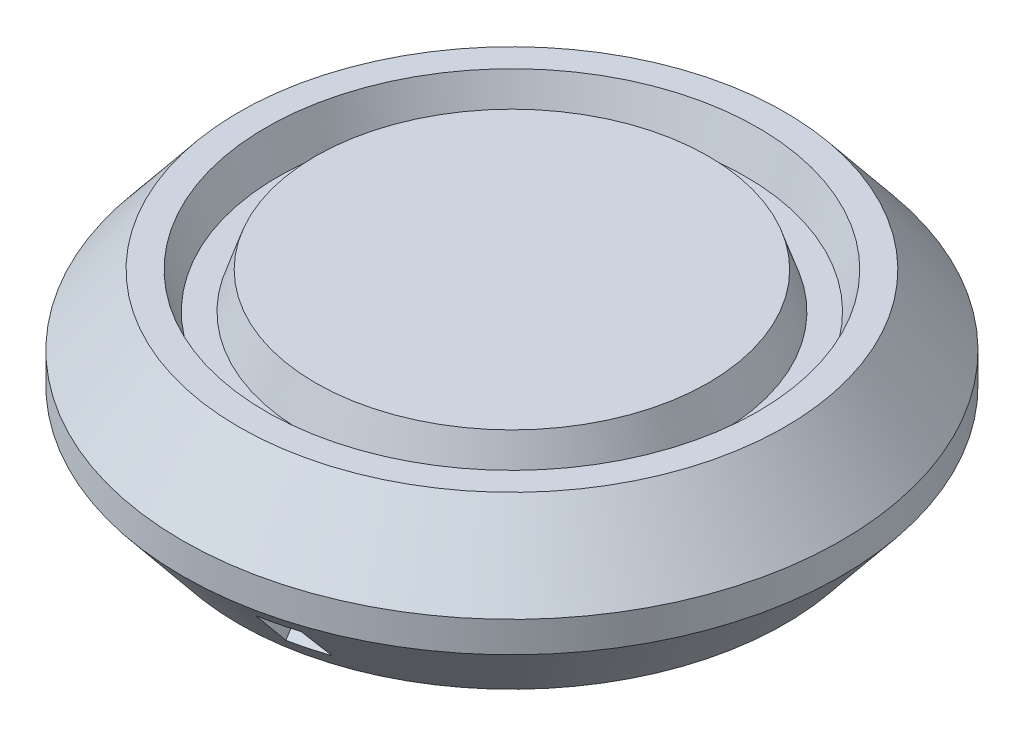
ISO-10303-21;
HEADER;
FILE_DESCRIPTION(('STEP AP214'),'2;1');
FILE_NAME('part.step','',(''),(''),'','','');
FILE_SCHEMA(('AUTOMOTIVE_DESIGN { 1 0 10303 214 1 1 1 1 }'));
ENDSEC;
DATA;
#1=APPLICATION_CONTEXT('core data for automotive mechanical design processes');
#2=APPLICATION_PROTOCOL_DEFINITION('international standard','automotive_design',2000,#1);
#3=PRODUCT_CONTEXT('',#1,'mechanical');
#4=PRODUCT('Part','Part','',(#3));
#5=PRODUCT_RELATED_PRODUCT_CATEGORY('part','',(#4));
#6=PRODUCT_DEFINITION_FORMATION('','',#4);
#7=PRODUCT_DEFINITION_CONTEXT('part definition',#1,'design');
#8=PRODUCT_DEFINITION('design','',#6,#7);
#9=PRODUCT_DEFINITION_SHAPE('','',#8);
#10=(LENGTH_UNIT() NAMED_UNIT(*) SI_UNIT(.MILLI.,.METRE.));
#11=(NAMED_UNIT(*) PLANE_ANGLE_UNIT() SI_UNIT($,.RADIAN.));
#12=(NAMED_UNIT(*) SI_UNIT($,.STERADIAN.) SOLID_ANGLE_UNIT());
#13=UNCERTAINTY_MEASURE_WITH_UNIT(LENGTH_MEASURE(1.E-05),#10,'distance_accuracy_value','');
#14=(GEOMETRIC_REPRESENTATION_CONTEXT(3) GLOBAL_UNCERTAINTY_ASSIGNED_CONTEXT((#13)) GLOBAL_UNIT_ASSIGNED_CONTEXT((#10,
#11,#12)) REPRESENTATION_CONTEXT('',''));
#15=CARTESIAN_POINT('',(0.,0.,0.));
#16=DIRECTION('',(0.,0.,1.));
#17=DIRECTION('',(1.,0.,0.));
#18=AXIS2_PLACEMENT_3D('',#15,#16,#17);
#19=CARTESIAN_POINT('',(0.,-17.7017454642295,-48.0015434816671));
#20=DIRECTION('',(0.,1.,0.));
#21=DIRECTION('',(0.,0.,1.));
#22=AXIS2_PLACEMENT_3D('',#19,#20,#21);
#23=CONICAL_SURFACE('',#22,57.9692464386835,0.681115401235544);
#24=CARTESIAN_POINT('',(0.,-20.2017454642295,-48.0015434816671));
#25=DIRECTION('',(0.,-1.,0.));
#26=DIRECTION('',(-1.,0.,0.));
#27=AXIS2_PLACEMENT_3D('',#24,#25,#26);
#28=CIRCLE('',#27,55.9429768373251);
#29=CARTESIAN_POINT('',(16.0140446036371,-20.2017453583716,5.6003874756999));
#30=VERTEX_POINT('',#29);
#31=CARTESIAN_POINT('',(10.4402159712432,-20.2017450840814,6.95861004367383));
#32=VERTEX_POINT('',#31);
#33=EDGE_CURVE('E157',#30,#32,#28,.T.);
#34=ORIENTED_EDGE('',*,*,#33,.F.);
#35=CARTESIAN_POINT('',(0.,-20.2017454642295,-48.0015434816671));
#36=DIRECTION('',(0.,-1.,0.));
#37=DIRECTION('',(-1.,0.,0.));
#38=AXIS2_PLACEMENT_3D('',#35,#36,#37);
#39=CIRCLE('',#38,55.9429768373251);
#40=CARTESIAN_POINT('',(16.4000417315379,-20.2018818766836,5.48372632574843));
#41=VERTEX_POINT('',#40);
#42=EDGE_CURVE('E347',#30,#41,#39,.F.);
#43=ORIENTED_EDGE('',*,*,#42,.T.);
#44=CARTESIAN_POINT('',(16.4,-20.7298062275823,5.03573694342637));
#45=CARTESIAN_POINT('',(16.4,-20.553812434896,5.18504410852054));
#46=CARTESIAN_POINT('',(16.4,-20.3777918982308,5.33431929812387));
#47=CARTESIAN_POINT('',(16.4,-20.2017454642295,5.48356339325174));
#48=B_SPLINE_CURVE_WITH_KNOTS('',3,(#44,#45,#46,#47),.UNSPECIFIED.,.F.,.F.,(4,4),(0.,
0.0823548578453453),.UNSPECIFIED.);
#49=CARTESIAN_POINT('',(16.3999998841511,-20.7298058455405,5.03573649383886));
#50=VERTEX_POINT('',#49);
#51=EDGE_CURVE('E337',#41,#50,#48,.F.);
#52=ORIENTED_EDGE('',*,*,#51,.T.);
#53=CARTESIAN_POINT('',(16.4,-22.6243143243618,3.42631267500107));
#54=CARTESIAN_POINT('',(16.4,-21.993182471612,3.96322677115542));
#55=CARTESIAN_POINT('',(16.4,-21.361666712467,4.49968793684968));
#56=CARTESIAN_POINT('',(16.4,-20.7298062275823,5.03573694342637));
#57=B_SPLINE_CURVE_WITH_KNOTS('',3,(#53,#54,#55,#56),.UNSPECIFIED.,.F.,.F.,(4,4),
(0.0823548578453452,0.378028810980282),.UNSPECIFIED.);
#58=CARTESIAN_POINT('',(16.399998846304,-22.6243105190674,3.42630819919576));
#59=VERTEX_POINT('',#58);
#60=EDGE_CURVE('E156',#59,#50,#57,.T.);
#61=ORIENTED_EDGE('',*,*,#60,.F.);
#62=CARTESIAN_POINT('',(16.4,-26.6017454642295,0.0316095333716892));
#63=CARTESIAN_POINT('',(16.4,-25.277877012024,1.16543447836549));
#64=CARTESIAN_POINT('',(16.4,-23.9519450632923,2.2968756879217));
#65=CARTESIAN_POINT('',(16.4,-22.6243143243618,3.42631267500107));
#66=B_SPLINE_CURVE_WITH_KNOTS('',3,(#62,#63,#64,#65),.UNSPECIFIED.,.F.,.F.,(4,4),
(0.378028810980282,1.),.UNSPECIFIED.);
#67=CARTESIAN_POINT('',(16.4000201600085,-26.6018113634599,0.0316882441185635));
#68=VERTEX_POINT('',#67);
#69=EDGE_CURVE('E315',#59,#68,#66,.F.);
#70=ORIENTED_EDGE('',*,*,#69,.T.);
#71=CARTESIAN_POINT('',(0.,-26.6017454642295,-48.0015434816671));
#72=DIRECTION('',(0.,1.,0.));
#73=DIRECTION('',(1.,0.,0.));
#74=AXIS2_PLACEMENT_3D('',#71,#72,#73);
#75=CIRCLE('',#74,50.7557266578475);
#76=CARTESIAN_POINT('',(15.903030274097,-26.6017457439472,0.198429360550559));
#77=VERTEX_POINT('',#76);
#78=EDGE_CURVE('E83',#68,#77,#75,.F.);
#79=ORIENTED_EDGE('',*,*,#78,.T.);
#80=CARTESIAN_POINT('',(0.,-26.6017454642295,-48.0015434816671));
#81=DIRECTION('',(0.,1.,0.));
#82=DIRECTION('',(1.,0.,0.));
#83=AXIS2_PLACEMENT_3D('',#80,#81,#82);
#84=CIRCLE('',#83,50.7557266578475);
#85=CARTESIAN_POINT('',(10.431882766254,-26.6017453882256,1.67057724235531));
#86=VERTEX_POINT('',#85);
#87=EDGE_CURVE('E75',#86,#77,#84,.T.);
#88=ORIENTED_EDGE('',*,*,#87,.F.);
#89=CARTESIAN_POINT('',(0.,-26.6017454642295,-48.0015434816671));
#90=DIRECTION('',(0.,1.,0.));
#91=DIRECTION('',(1.,0.,0.));
#92=AXIS2_PLACEMENT_3D('',#89,#90,#91);
#93=CIRCLE('',#92,50.7557266578475);
#94=CARTESIAN_POINT('',(10.0000433049946,-26.6018870198108,1.75949162895307));
#95=VERTEX_POINT('',#94);
#96=EDGE_CURVE('E285',#86,#95,#93,.F.);
#97=ORIENTED_EDGE('',*,*,#96,.T.);
#98=CARTESIAN_POINT('',(10.,-25.9837417900706,2.27013368231279));
#99=CARTESIAN_POINT('',(10.,-26.1897592497095,2.09988295029527));
#100=CARTESIAN_POINT('',(10.,-26.3957606142117,1.92961273939977));
#101=CARTESIAN_POINT('',(10.,-26.6017454642295,1.75932255346265));
#102=B_SPLINE_CURVE_WITH_KNOTS('',3,(#98,#99,#100,#101),.UNSPECIFIED.,.F.,.F.,(4,4),(0.,
0.096628493571583),.UNSPECIFIED.);
#103=CARTESIAN_POINT('',(9.99999989556523,-25.9837414516257,2.27013327219588));
#104=VERTEX_POINT('',#103);
#105=EDGE_CURVE('E99',#95,#104,#102,.F.);
#106=ORIENTED_EDGE('',*,*,#105,.T.);
#107=CARTESIAN_POINT('',(10.,-24.1467188824177,3.78738445298466));
#108=CARTESIAN_POINT('',(10.,-24.7591946427657,3.28179752333905));
#109=CARTESIAN_POINT('',(10.,-25.3715392799569,2.77605160632041));
#110=CARTESIAN_POINT('',(10.,-25.9837417900706,2.27013368231279));
#111=B_SPLINE_CURVE_WITH_KNOTS('',3,(#107,#108,#109,#110),.UNSPECIFIED.,.F.,.F.,(4,4),
(0.096628493571583,0.383770206787166),.UNSPECIFIED.);
#112=CARTESIAN_POINT('',(9.99999961325553,-24.1467176284025,3.78738293472047));
#113=VERTEX_POINT('',#112);
#114=EDGE_CURVE('E107',#113,#104,#111,.T.);
#115=ORIENTED_EDGE('',*,*,#114,.F.);
#116=CARTESIAN_POINT('',(10.,-20.2017454642295,7.04041013029593));
#117=CARTESIAN_POINT('',(10.,-21.5172680040189,5.95671468935022));
#118=CARTESIAN_POINT('',(10.,-22.8322953982069,4.87241569284742));
#119=CARTESIAN_POINT('',(10.,-24.1467188824177,3.78738445298466));
#120=B_SPLINE_CURVE_WITH_KNOTS('',3,(#116,#117,#118,#119),.UNSPECIFIED.,.F.,.F.,(4,4),
(0.383770206787166,1.),.UNSPECIFIED.);
#121=CARTESIAN_POINT('',(10.000021139838,-20.2018145663361,7.04049266659241));
#122=VERTEX_POINT('',#121);
#123=EDGE_CURVE('E245',#113,#122,#120,.F.);
#124=ORIENTED_EDGE('',*,*,#123,.T.);
#125=CARTESIAN_POINT('',(0.,-20.2017454642295,-48.0015434816671));
#126=DIRECTION('',(0.,-1.,0.));
#127=DIRECTION('',(-1.,0.,0.));
#128=AXIS2_PLACEMENT_3D('',#125,#126,#127);
#129=CIRCLE('',#128,55.9429768373251);
#130=EDGE_CURVE('E153',#122,#32,#129,.F.);
#131=ORIENTED_EDGE('',*,*,#130,.T.);
#132=EDGE_LOOP('',(#34,#43,#52,#61,#70,#79,#88,#97,#106,#115,#124,#131));
#133=FACE_BOUND('',#132,.T.);
#134=CARTESIAN_POINT('',(0.,-30.0017454642295,-48.0015434816671));
#135=DIRECTION('',(0.,-1.,0.));
#136=DIRECTION('',(0.,0.,-1.));
#137=AXIS2_PLACEMENT_3D('',#134,#135,#136);
#138=CIRCLE('',#137,48.);
#139=CARTESIAN_POINT('',(0.,-30.0017454642295,-96.0015434816671));
#140=VERTEX_POINT('',#139);
#141=EDGE_CURVE('E422',#140,#140,#138,.T.);
#142=ORIENTED_EDGE('',*,*,#141,.F.);
#143=EDGE_LOOP('',(#142));
#144=FACE_BOUND('',#143,.T.);
#145=CARTESIAN_POINT('',(0.,-17.7017454642295,-48.0015434816671));
#146=DIRECTION('',(0.,1.,0.));
#147=DIRECTION('',(0.,0.,1.));
#148=AXIS2_PLACEMENT_3D('',#145,#146,#147);
#149=CIRCLE('',#148,57.9692464386835);
#150=CARTESIAN_POINT('',(0.,-17.7017454642295,9.96770295701639));
#151=VERTEX_POINT('',#150);
#152=EDGE_CURVE('E408',#151,#151,#149,.T.);
#153=ORIENTED_EDGE('',*,*,#152,.F.);
#154=EDGE_LOOP('',(#153));
#155=FACE_BOUND('',#154,.T.);
#156=ADVANCED_FACE('F65',(#133,#144,#155),#23,.T.);
#157=CARTESIAN_POINT('',(0.,-0.00174546422951989,-0.00154348166710403));
#158=DIRECTION('',(0.,1.,0.));
#159=DIRECTION('',(0.,0.,1.));
#160=AXIS2_PLACEMENT_3D('',#157,#158,#159);
#161=PLANE('',#160);
#162=CARTESIAN_POINT('',(0.,-0.00174546422951338,-48.0015434816671));
#163=DIRECTION('',(0.,1.,0.));
#164=DIRECTION('',(1.,0.,0.));
#165=AXIS2_PLACEMENT_3D('',#162,#163,#164);
#166=CIRCLE('',#165,43.2639869793906);
#167=CARTESIAN_POINT('',(43.2639869793906,-0.00174546422951338,-48.0015434816671));
#168=VERTEX_POINT('',#167);
#169=EDGE_CURVE('E433',#168,#168,#166,.T.);
#170=ORIENTED_EDGE('',*,*,#169,.F.);
#171=EDGE_LOOP('',(#170));
#172=FACE_BOUND('',#171,.T.);
#173=CARTESIAN_POINT('',(0.,-0.00174546422951989,-48.0015434816671));
#174=DIRECTION('',(0.,1.,0.));
#175=DIRECTION('',(0.,0.,1.));
#176=AXIS2_PLACEMENT_3D('',#173,#174,#175);
#177=CIRCLE('',#176,48.);
#178=CARTESIAN_POINT('',(0.,-0.00174546422951989,-0.00154348166710172));
#179=VERTEX_POINT('',#178);
#180=EDGE_CURVE('E406',#179,#179,#177,.T.);
#181=ORIENTED_EDGE('',*,*,#180,.T.);
#182=EDGE_LOOP('',(#181));
#183=FACE_BOUND('',#182,.T.);
#184=ADVANCED_FACE('F489',(#172,#183),#161,.T.);
#185=CARTESIAN_POINT('',(0.,-0.00174546422951989,-48.0015434816671));
#186=DIRECTION('',(0.,1.,0.));
#187=DIRECTION('',(0.,0.,1.));
#188=AXIS2_PLACEMENT_3D('',#185,#186,#187);
#189=CYLINDRICAL_SURFACE('',#188,57.9692464386835);
#190=ORIENTED_EDGE('',*,*,#152,.T.);
#191=EDGE_LOOP('',(#190));
#192=FACE_BOUND('',#191,.T.);
#193=CARTESIAN_POINT('',(0.,-12.3017454642295,-48.0015434816671));
#194=DIRECTION('',(0.,1.,0.));
#195=DIRECTION('',(0.,0.,1.));
#196=AXIS2_PLACEMENT_3D('',#193,#194,#195);
#197=CIRCLE('',#196,57.9692464386835);
#198=CARTESIAN_POINT('',(0.,-12.3017454642295,9.96770295701639));
#199=VERTEX_POINT('',#198);
#200=EDGE_CURVE('E413',#199,#199,#197,.T.);
#201=ORIENTED_EDGE('',*,*,#200,.F.);
#202=EDGE_LOOP('',(#201));
#203=FACE_BOUND('',#202,.T.);
#204=ADVANCED_FACE('F493',(#192,#203),#189,.T.);
#205=CARTESIAN_POINT('',(0.,-0.00174546422951989,-48.0015434816671));
#206=DIRECTION('',(0.,-1.,0.));
#207=DIRECTION('',(0.,0.,-1.));
#208=AXIS2_PLACEMENT_3D('',#205,#206,#207);
#209=CONICAL_SURFACE('',#208,48.,0.681115401235544);
#210=ORIENTED_EDGE('',*,*,#200,.T.);
#211=EDGE_LOOP('',(#210));
#212=FACE_BOUND('',#211,.T.);
#213=ORIENTED_EDGE('',*,*,#180,.F.);
#214=EDGE_LOOP('',(#213));
#215=FACE_BOUND('',#214,.T.);
#216=ADVANCED_FACE('F500',(#212,#215),#209,.T.);
#217=CARTESIAN_POINT('',(0.,-6.19693686115104,-48.0015434816671));
#218=DIRECTION('',(0.,1.,0.));
#219=DIRECTION('',(1.,0.,0.));
#220=AXIS2_PLACEMENT_3D('',#217,#218,#219);
#221=CONICAL_SURFACE('',#220,41.1911049345612,0.322885911618952);
#222=ORIENTED_EDGE('',*,*,#169,.T.);
#223=EDGE_LOOP('',(#222));
#224=FACE_BOUND('',#223,.T.);
#225=CARTESIAN_POINT('',(0.,-6.4017454642295,-48.0015434816671));
#226=DIRECTION('',(0.,1.,0.));
#227=DIRECTION('',(1.,0.,0.));
#228=AXIS2_PLACEMENT_3D('',#225,#226,#227);
#229=CIRCLE('',#228,41.1225769345774);
#230=CARTESIAN_POINT('',(41.1225769345774,-6.4017454642295,-48.0015434816671));
#231=VERTEX_POINT('',#230);
#232=EDGE_CURVE('E430',#231,#231,#229,.T.);
#233=ORIENTED_EDGE('',*,*,#232,.F.);
#234=EDGE_LOOP('',(#233));
#235=FACE_BOUND('',#234,.T.);
#236=ADVANCED_FACE('F508',(#224,#235),#221,.F.);
#237=CARTESIAN_POINT('',(0.,-6.4017454642295,-48.0015434816671));
#238=DIRECTION('',(0.,1.,0.));
#239=DIRECTION('',(1.,0.,0.));
#240=AXIS2_PLACEMENT_3D('',#237,#238,#239);
#241=PLANE('',#240);
#242=ORIENTED_EDGE('',*,*,#232,.T.);
#243=EDGE_LOOP('',(#242));
#244=FACE_BOUND('',#243,.T.);
#245=CARTESIAN_POINT('',(0.,-6.4017454642295,-48.0015434816671));
#246=DIRECTION('',(0.,1.,0.));
#247=DIRECTION('',(1.,0.,0.));
#248=AXIS2_PLACEMENT_3D('',#245,#246,#247);
#249=CIRCLE('',#248,36.6906387414213);
#250=CARTESIAN_POINT('',(36.6906387414213,-6.4017454642295,-48.0015434816671));
#251=VERTEX_POINT('',#250);
#252=EDGE_CURVE('E427',#251,#251,#249,.T.);
#253=ORIENTED_EDGE('',*,*,#252,.F.);
#254=EDGE_LOOP('',(#253));
#255=FACE_BOUND('',#254,.T.);
#256=ADVANCED_FACE('F515',(#244,#255),#241,.T.);
#257=CARTESIAN_POINT('',(0.,-6.19693686115104,-48.0015434816671));
#258=DIRECTION('',(0.,-1.,0.));
#259=DIRECTION('',(1.,0.,0.));
#260=AXIS2_PLACEMENT_3D('',#257,#258,#259);
#261=CONICAL_SURFACE('',#260,36.6221107414375,0.322885911618952);
#262=CARTESIAN_POINT('',(0.,-0.00174546422951338,-48.0015434816671));
#263=DIRECTION('',(0.,1.,0.));
#264=DIRECTION('',(1.,0.,0.));
#265=AXIS2_PLACEMENT_3D('',#262,#263,#264);
#266=CIRCLE('',#265,34.549228696608);
#267=CARTESIAN_POINT('',(34.549228696608,-0.00174546422951338,-48.0015434816671));
#268=VERTEX_POINT('',#267);
#269=EDGE_CURVE('E423',#268,#268,#266,.T.);
#270=ORIENTED_EDGE('',*,*,#269,.F.);
#271=EDGE_LOOP('',(#270));
#272=FACE_BOUND('',#271,.T.);
#273=ORIENTED_EDGE('',*,*,#252,.T.);
#274=EDGE_LOOP('',(#273));
#275=FACE_BOUND('',#274,.T.);
#276=ADVANCED_FACE('F506',(#272,#275),#261,.T.);
#277=ORIENTED_EDGE('',*,*,#269,.T.);
#278=EDGE_LOOP('',(#277));
#279=FACE_BOUND('',#278,.T.);
#280=ADVANCED_FACE('F496',(#279),#161,.T.);
#281=CARTESIAN_POINT('',(0.,-27.0017454642295,-48.0015434816671));
#282=DIRECTION('',(0.,-1.,0.));
#283=DIRECTION('',(0.,0.,-1.));
#284=AXIS2_PLACEMENT_3D('',#281,#282,#283);
#285=PLANE('',#284);
#286=CARTESIAN_POINT('',(0.,-27.0017454642295,-48.0015434816671));
#287=DIRECTION('',(0.,-1.,0.));
#288=DIRECTION('',(0.,0.,-1.));
#289=AXIS2_PLACEMENT_3D('',#286,#287,#288);
#290=CIRCLE('',#289,48.);
#291=CARTESIAN_POINT('',(0.,-27.0017454642295,-96.0015434816671));
#292=VERTEX_POINT('',#291);
#293=EDGE_CURVE('E426',#292,#292,#290,.T.);
#294=ORIENTED_EDGE('',*,*,#293,.T.);
#295=EDGE_LOOP('',(#294));
#296=FACE_BOUND('',#295,.T.);
#297=CARTESIAN_POINT('',(0.,-27.0017454642295,-48.0015434816671));
#298=DIRECTION('',(0.,-1.,0.));
#299=DIRECTION('',(0.,0.,-1.));
#300=AXIS2_PLACEMENT_3D('',#297,#298,#299);
#301=CIRCLE('',#300,46.5698779350646);
#302=CARTESIAN_POINT('',(0.,-27.0017454642295,-94.5714214167318));
#303=VERTEX_POINT('',#302);
#304=EDGE_CURVE('E438',#303,#303,#301,.F.);
#305=ORIENTED_EDGE('',*,*,#304,.T.);
#306=EDGE_LOOP('',(#305));
#307=FACE_BOUND('',#306,.T.);
#308=ADVANCED_FACE('F505',(#296,#307),#285,.T.);
#309=CARTESIAN_POINT('',(0.,-27.0017454642295,-48.0015434816671));
#310=DIRECTION('',(0.,-1.,0.));
#311=DIRECTION('',(0.,0.,-1.));
#312=AXIS2_PLACEMENT_3D('',#309,#310,#311);
#313=CYLINDRICAL_SURFACE('',#312,48.);
#314=ORIENTED_EDGE('',*,*,#293,.F.);
#315=EDGE_LOOP('',(#314));
#316=FACE_BOUND('',#315,.T.);
#317=ORIENTED_EDGE('',*,*,#141,.T.);
#318=EDGE_LOOP('',(#317));
#319=FACE_BOUND('',#318,.T.);
#320=ADVANCED_FACE('F470',(#316,#319),#313,.F.);
#321=CARTESIAN_POINT('',(0.,-8.40174546422952,-0.00154348166710403));
#322=DIRECTION('',(0.,1.,0.));
#323=DIRECTION('',(0.,0.,1.));
#324=AXIS2_PLACEMENT_3D('',#321,#322,#323);
#325=PLANE('',#324);
#326=CARTESIAN_POINT('',(-27.5232465854405,-8.40174546422952,-75.5133759842099));
#327=DIRECTION('',(0.,-1.,0.));
#328=DIRECTION('',(0.,0.,-1.));
#329=AXIS2_PLACEMENT_3D('',#326,#327,#328);
#330=CIRCLE('',#329,1.25);
#331=CARTESIAN_POINT('',(-27.5232465854405,-8.40174546422952,-76.7633759842099));
#332=VERTEX_POINT('',#331);
#333=EDGE_CURVE('E367',#332,#332,#330,.T.);
#334=ORIENTED_EDGE('',*,*,#333,.F.);
#335=EDGE_LOOP('',(#334));
#336=FACE_BOUND('',#335,.T.);
#337=CARTESIAN_POINT('',(27.5858996083116,-8.40174546422952,-75.5133759842099));
#338=DIRECTION('',(0.,-1.,0.));
#339=DIRECTION('',(0.,0.,-1.));
#340=AXIS2_PLACEMENT_3D('',#337,#338,#339);
#341=CIRCLE('',#340,1.25);
#342=CARTESIAN_POINT('',(27.5858996083116,-8.40174546422952,-76.7633759842099));
#343=VERTEX_POINT('',#342);
#344=EDGE_CURVE('E452',#343,#343,#341,.T.);
#345=ORIENTED_EDGE('',*,*,#344,.F.);
#346=EDGE_LOOP('',(#345));
#347=FACE_BOUND('',#346,.T.);
#348=CARTESIAN_POINT('',(27.4497199178088,-8.40174546422952,-20.4897035900329));
#349=DIRECTION('',(0.,-1.,0.));
#350=DIRECTION('',(0.,0.,-1.));
#351=AXIS2_PLACEMENT_3D('',#348,#349,#350);
#352=CIRCLE('',#351,1.25);
#353=CARTESIAN_POINT('',(27.4497199178088,-8.40174546422952,-21.7397035900329));
#354=VERTEX_POINT('',#353);
#355=EDGE_CURVE('E446',#354,#354,#352,.T.);
#356=ORIENTED_EDGE('',*,*,#355,.F.);
#357=EDGE_LOOP('',(#356));
#358=FACE_BOUND('',#357,.T.);
#359=CARTESIAN_POINT('',(-27.3943529981384,-8.40174546422952,-20.4915972566209));
#360=DIRECTION('',(0.,-1.,0.));
#361=DIRECTION('',(0.,0.,-1.));
#362=AXIS2_PLACEMENT_3D('',#359,#360,#361);
#363=CIRCLE('',#362,1.25);
#364=CARTESIAN_POINT('',(-27.3943529981384,-8.40174546422952,-21.7415972566209));
#365=VERTEX_POINT('',#364);
#366=EDGE_CURVE('E166',#365,#365,#363,.T.);
#367=ORIENTED_EDGE('',*,*,#366,.F.);
#368=EDGE_LOOP('',(#367));
#369=FACE_BOUND('',#368,.T.);
#370=CARTESIAN_POINT('',(0.,-8.40174546422952,-48.0015434816671));
#371=DIRECTION('',(0.,1.,0.));
#372=DIRECTION('',(0.,0.,1.));
#373=AXIS2_PLACEMENT_3D('',#370,#371,#372);
#374=CIRCLE('',#373,50.9466202739989);
#375=CARTESIAN_POINT('',(0.,-8.40174546422952,2.94507679233177));
#376=VERTEX_POINT('',#375);
#377=EDGE_CURVE('E419',#376,#376,#374,.T.);
#378=ORIENTED_EDGE('',*,*,#377,.F.);
#379=EDGE_LOOP('',(#378));
#380=FACE_BOUND('',#379,.T.);
#381=ADVANCED_FACE('F466',(#336,#347,#358,#369,#380),#325,.F.);
#382=CARTESIAN_POINT('',(0.,-1.8907252790183,-48.0015434816671));
#383=DIRECTION('',(0.,-1.,0.));
#384=DIRECTION('',(0.,0.,-1.));
#385=AXIS2_PLACEMENT_3D('',#382,#383,#384);
#386=CONICAL_SURFACE('',#385,45.669387363949,0.681115401235544);
#387=CARTESIAN_POINT('',(0.,-13.3648389267034,-48.0015434816671));
#388=DIRECTION('',(0.,-1.,0.));
#389=DIRECTION('',(0.,0.,-1.));
#390=AXIS2_PLACEMENT_3D('',#387,#388,#389);
#391=CIRCLE('',#390,54.9692464386835);
#392=CARTESIAN_POINT('',(0.,-13.3648389267034,-102.970789920351));
#393=VERTEX_POINT('',#392);
#394=EDGE_CURVE('E145',#393,#393,#391,.F.);
#395=ORIENTED_EDGE('',*,*,#394,.F.);
#396=EDGE_LOOP('',(#395));
#397=FACE_BOUND('',#396,.T.);
#398=ORIENTED_EDGE('',*,*,#377,.T.);
#399=EDGE_LOOP('',(#398));
#400=FACE_BOUND('',#399,.T.);
#401=ADVANCED_FACE('F469',(#397,#400),#386,.F.);
#402=CARTESIAN_POINT('',(0.,-0.00174546422951989,-48.0015434816671));
#403=DIRECTION('',(0.,1.,0.));
#404=DIRECTION('',(0.,0.,1.));
#405=AXIS2_PLACEMENT_3D('',#402,#403,#404);
#406=CYLINDRICAL_SURFACE('',#405,54.9692464386835);
#407=CARTESIAN_POINT('',(0.,-16.6386520017557,-48.0015434816671));
#408=DIRECTION('',(0.,1.,0.));
#409=DIRECTION('',(0.,0.,1.));
#410=AXIS2_PLACEMENT_3D('',#407,#408,#409);
#411=CIRCLE('',#410,54.9692464386835);
#412=CARTESIAN_POINT('',(0.,-16.6386520017557,6.96770295701639));
#413=VERTEX_POINT('',#412);
#414=EDGE_CURVE('E163',#413,#413,#411,.T.);
#415=ORIENTED_EDGE('',*,*,#414,.F.);
#416=EDGE_LOOP('',(#415));
#417=FACE_BOUND('',#416,.T.);
#418=ORIENTED_EDGE('',*,*,#394,.T.);
#419=EDGE_LOOP('',(#418));
#420=FACE_BOUND('',#419,.T.);
#421=ADVANCED_FACE('F479',(#417,#420),#406,.F.);
#422=CARTESIAN_POINT('',(0.,-15.8127656494407,-48.0015434816671));
#423=DIRECTION('',(0.,1.,0.));
#424=DIRECTION('',(0.,0.,1.));
#425=AXIS2_PLACEMENT_3D('',#422,#423,#424);
#426=CONICAL_SURFACE('',#425,55.6386338026325,0.681115401235544);
#427=CARTESIAN_POINT('',(9.3607196771406,-18.3071231151398,4.79194964109363));
#428=CARTESIAN_POINT('',(9.36082759523286,-19.3748392838541,3.91303409379063));
#429=CARTESIAN_POINT('',(9.36093695036452,-20.4422330857513,3.03372678709344));
#430=CARTESIAN_POINT('',(9.36110108188865,-22.0427480675182,1.71406695701809));
#431=CARTESIAN_POINT('',(9.36115580888544,-22.5761572796126,1.27406372684449));
#432=CARTESIAN_POINT('',(9.36126495302605,-23.6427683782834,0.393805817415115));
#433=CARTESIAN_POINT('',(9.36131937016982,-24.1759702648149,-0.0464488618950466));
#434=CARTESIAN_POINT('',(9.36137346098338,-24.7090607212818,-0.486838463839126));
#435=B_SPLINE_CURVE_WITH_KNOTS('',3,(#427,#428,#429,#430,#431,#432,#433,#434),.UNSPECIFIED.,.F.,
.F.,(4,2,2,4),(0.,4.14880623290269,6.22321068542797,8.2976155868383),.UNSPECIFIED.);
#436=CARTESIAN_POINT('',(9.36071967714059,-18.3071231151398,4.79194964109362));
#437=VERTEX_POINT('',#436);
#438=CARTESIAN_POINT('',(9.36137346098338,-24.7090607212818,-0.486838463839109));
#439=VERTEX_POINT('',#438);
#440=EDGE_CURVE('E134',#437,#439,#435,.T.);
#441=ORIENTED_EDGE('',*,*,#440,.T.);
#442=CARTESIAN_POINT('',(9.36137346098338,-24.7090607212818,-0.486838463839142));
#443=CARTESIAN_POINT('',(9.57851102011856,-24.7094719552015,-0.529958640632168));
#444=CARTESIAN_POINT('',(9.79535835660049,-24.7098488277331,-0.574540591126239));
#445=CARTESIAN_POINT('',(10.22827669604,-24.7105337456046,-0.666586405209425));
#446=CARTESIAN_POINT('',(10.4443481470607,-24.710841840528,-0.714048161066395));
#447=CARTESIAN_POINT('',(10.8757160346837,-24.711389544625,-0.811847825070586));
#448=CARTESIAN_POINT('',(11.0910128280527,-24.7116291908503,-0.862184159409825));
#449=CARTESIAN_POINT('',(11.5208324029723,-24.7120402501992,-0.965728615750141));
#450=CARTESIAN_POINT('',(11.7353554363089,-24.7122116879706,-1.01893569247458));
#451=CARTESIAN_POINT('',(12.163628140405,-24.7124865054213,-1.12821885012801));
#452=CARTESIAN_POINT('',(12.3773779442085,-24.7125898974227,-1.18429440963571));
#453=CARTESIAN_POINT('',(12.8041046083261,-24.7127287183869,-1.2993133051592));
#454=CARTESIAN_POINT('',(13.0170814686133,-24.7127641473474,-1.35825664127442));
#455=CARTESIAN_POINT('',(13.4422622452821,-24.7127670582903,-1.47901139169043));
#456=CARTESIAN_POINT('',(13.6544660146598,-24.7127345279632,-1.54082332359695));
#457=CARTESIAN_POINT('',(14.0781000719137,-24.7126014565398,-1.6673170429185));
#458=CARTESIAN_POINT('',(14.2895300521616,-24.7125008908409,-1.73199986057322));
#459=CARTESIAN_POINT('',(14.7116155330337,-24.7122316077415,-1.86423867950905));
#460=CARTESIAN_POINT('',(14.9222705511358,-24.7120628533887,-1.931796220852));
#461=CARTESIAN_POINT('',(15.3428047097414,-24.7116569641378,-2.06978918632662));
#462=CARTESIAN_POINT('',(15.5526831782622,-24.7114197798317,-2.14022665818858));
#463=CARTESIAN_POINT('',(15.7620778782229,-24.7111483886123,-2.21207392553462));
#464=B_SPLINE_CURVE_WITH_KNOTS('',3,(#442,#443,#444,#445,#446,#447,#448,#449,#450,#451,#452,
#453,#454,#455,#456,#457,#458,#459,#460,#461,#462,#463),.UNSPECIFIED.,.F.,.F.,(4,2,2,2,2,2,2,2,
2,2,4),(0.,0.664129109823264,1.32777787291737,1.99106671376261,2.65411565085753,
3.31704448692354,3.97997334597196,4.64302229169636,5.3063111325453,5.96995990136393,
6.63408904570637),.UNSPECIFIED.);
#465=CARTESIAN_POINT('',(15.7620778782229,-24.7111483886123,-2.21207392553462));
#466=VERTEX_POINT('',#465);
#467=EDGE_CURVE('E144',#439,#466,#464,.T.);
#468=ORIENTED_EDGE('',*,*,#467,.T.);
#469=CARTESIAN_POINT('',(15.7620778782229,-24.7111483886123,-2.2120739255346));
#470=CARTESIAN_POINT('',(15.7621384198959,-24.1791927010658,-1.75611475913049));
#471=CARTESIAN_POINT('',(15.762192213802,-23.646885491383,-1.30056604984733));
#472=CARTESIAN_POINT('',(15.7622881373813,-22.5816187245847,-0.390232021590413));
#473=CARTESIAN_POINT('',(15.7623302670551,-22.0486591674977,0.0645532974167226));
#474=CARTESIAN_POINT('',(15.7624419046804,-20.4489066960803,1.42782601838419));
#475=CARTESIAN_POINT('',(15.7624966643018,-19.3812113009435,2.33525475666296));
#476=CARTESIAN_POINT('',(15.7625390837495,-18.3125152542375,3.24150207469113));
#477=B_SPLINE_CURVE_WITH_KNOTS('',3,(#469,#470,#471,#472,#473,#474,#475,#476),.UNSPECIFIED.,.F.,
.F.,(4,2,2,4),(0.,2.10187489548318,4.20374969907109,8.40738600422716),.UNSPECIFIED.);
#478=CARTESIAN_POINT('',(15.7625390837495,-18.3125152542375,3.24150207469112));
#479=VERTEX_POINT('',#478);
#480=EDGE_CURVE('E162',#466,#479,#477,.T.);
#481=ORIENTED_EDGE('',*,*,#480,.T.);
#482=CARTESIAN_POINT('',(15.7625390837495,-18.3125152542375,3.24150207469111));
#483=CARTESIAN_POINT('',(15.5523450191333,-18.3126112018293,3.30607721330052));
#484=CARTESIAN_POINT('',(15.3417601556341,-18.3126795724775,3.36938044240552));
#485=CARTESIAN_POINT('',(14.9199631389763,-18.3127611454936,3.49339781884135));
#486=CARTESIAN_POINT('',(14.7087514244101,-18.3127743800838,3.55411345785609));
#487=CARTESIAN_POINT('',(14.2857019496746,-18.3127457849794,3.67295985064641));
#488=CARTESIAN_POINT('',(14.0738645044481,-18.312703979415,3.73109172562545));
#489=CARTESIAN_POINT('',(13.6495641207767,-18.3125653477062,3.84477390470312));
#490=CARTESIAN_POINT('',(13.4371013832156,-18.3124685376445,3.90032495826775));
#491=CARTESIAN_POINT('',(13.0115522890563,-18.312219901582,4.00884722200917));
#492=CARTESIAN_POINT('',(12.7984660282336,-18.3120680836316,4.06181880839979));
#493=CARTESIAN_POINT('',(11.5175955835986,-18.3109914628644,4.37202928878383));
#494=CARTESIAN_POINT('',(10.4422652599036,-18.309404777023,4.59831031790569));
#495=CARTESIAN_POINT('',(9.36071967714059,-18.3071231151398,4.79194964109362));
#496=B_SPLINE_CURVE_WITH_KNOTS('',3,(#482,#483,#484,#485,#486,#487,#488,#489,#490,#491,#492,
#493,#494,#495),.UNSPECIFIED.,.F.,.F.,(4,2,2,2,2,2,4),(0.,0.659665292054949,1.31894501170476,
1.97793579192942,2.6367339906444,3.29543581444516,6.59038971527543),.UNSPECIFIED.);
#497=EDGE_CURVE('E150',#479,#437,#496,.T.);
#498=ORIENTED_EDGE('',*,*,#497,.T.);
#499=EDGE_LOOP('',(#441,#468,#481,#498));
#500=FACE_BOUND('',#499,.T.);
#501=ORIENTED_EDGE('',*,*,#414,.T.);
#502=EDGE_LOOP('',(#501));
#503=FACE_BOUND('',#502,.T.);
#504=ORIENTED_EDGE('',*,*,#304,.F.);
#505=EDGE_LOOP('',(#504));
#506=FACE_BOUND('',#505,.T.);
#507=ADVANCED_FACE('F160',(#500,#503,#506),#426,.F.);
#508=CARTESIAN_POINT('',(-27.3943529981384,-7.40174546422952,-20.4915972566209));
#509=DIRECTION('',(0.,-1.,0.));
#510=DIRECTION('',(0.,0.,-1.));
#511=AXIS2_PLACEMENT_3D('',#508,#509,#510);
#512=CYLINDRICAL_SURFACE('',#511,1.25);
#513=CARTESIAN_POINT('',(-27.3943529981384,-7.40174546422952,-20.4915972566209));
#514=DIRECTION('',(0.,-1.,0.));
#515=DIRECTION('',(0.,0.,-1.));
#516=AXIS2_PLACEMENT_3D('',#513,#514,#515);
#517=CIRCLE('',#516,1.25);
#518=CARTESIAN_POINT('',(-27.3943529981384,-7.40174546422952,-21.7415972566209));
#519=VERTEX_POINT('',#518);
#520=EDGE_CURVE('E443',#519,#519,#517,.T.);
#521=ORIENTED_EDGE('',*,*,#520,.F.);
#522=EDGE_LOOP('',(#521));
#523=FACE_BOUND('',#522,.T.);
#524=ORIENTED_EDGE('',*,*,#366,.T.);
#525=EDGE_LOOP('',(#524));
#526=FACE_BOUND('',#525,.T.);
#527=ADVANCED_FACE('F533',(#523,#526),#512,.F.);
#528=CARTESIAN_POINT('',(-27.3943529981384,-7.40174546422952,-20.4915972566209));
#529=DIRECTION('',(0.,-1.,0.));
#530=DIRECTION('',(0.,0.,-1.));
#531=AXIS2_PLACEMENT_3D('',#528,#529,#530);
#532=PLANE('',#531);
#533=ORIENTED_EDGE('',*,*,#520,.T.);
#534=EDGE_LOOP('',(#533));
#535=FACE_BOUND('',#534,.T.);
#536=ADVANCED_FACE('F536',(#535),#532,.T.);
#537=CARTESIAN_POINT('',(27.4497199178088,-7.40174546422952,-20.4897035900329));
#538=DIRECTION('',(0.,-1.,0.));
#539=DIRECTION('',(0.,0.,-1.));
#540=AXIS2_PLACEMENT_3D('',#537,#538,#539);
#541=CYLINDRICAL_SURFACE('',#540,1.25);
#542=CARTESIAN_POINT('',(27.4497199178088,-7.40174546422952,-20.4897035900329));
#543=DIRECTION('',(0.,-1.,0.));
#544=DIRECTION('',(0.,0.,-1.));
#545=AXIS2_PLACEMENT_3D('',#542,#543,#544);
#546=CIRCLE('',#545,1.25);
#547=CARTESIAN_POINT('',(27.4497199178088,-7.40174546422952,-21.7397035900329));
#548=VERTEX_POINT('',#547);
#549=EDGE_CURVE('E449',#548,#548,#546,.T.);
#550=ORIENTED_EDGE('',*,*,#549,.F.);
#551=EDGE_LOOP('',(#550));
#552=FACE_BOUND('',#551,.T.);
#553=ORIENTED_EDGE('',*,*,#355,.T.);
#554=EDGE_LOOP('',(#553));
#555=FACE_BOUND('',#554,.T.);
#556=ADVANCED_FACE('F540',(#552,#555),#541,.F.);
#557=CARTESIAN_POINT('',(27.4497199178088,-7.40174546422952,-20.4897035900329));
#558=DIRECTION('',(0.,-1.,0.));
#559=DIRECTION('',(0.,0.,-1.));
#560=AXIS2_PLACEMENT_3D('',#557,#558,#559);
#561=PLANE('',#560);
#562=ORIENTED_EDGE('',*,*,#549,.T.);
#563=EDGE_LOOP('',(#562));
#564=FACE_BOUND('',#563,.T.);
#565=ADVANCED_FACE('F462',(#564),#561,.T.);
#566=CARTESIAN_POINT('',(27.5858996083116,-7.40174546422952,-75.5133759842099));
#567=DIRECTION('',(0.,-1.,0.));
#568=DIRECTION('',(0.,0.,-1.));
#569=AXIS2_PLACEMENT_3D('',#566,#567,#568);
#570=CYLINDRICAL_SURFACE('',#569,1.25);
#571=CARTESIAN_POINT('',(27.5858996083116,-7.40174546422952,-75.5133759842099));
#572=DIRECTION('',(0.,-1.,0.));
#573=DIRECTION('',(0.,0.,-1.));
#574=AXIS2_PLACEMENT_3D('',#571,#572,#573);
#575=CIRCLE('',#574,1.25);
#576=CARTESIAN_POINT('',(27.5858996083116,-7.40174546422952,-76.7633759842099));
#577=VERTEX_POINT('',#576);
#578=EDGE_CURVE('E372',#577,#577,#575,.T.);
#579=ORIENTED_EDGE('',*,*,#578,.F.);
#580=EDGE_LOOP('',(#579));
#581=FACE_BOUND('',#580,.T.);
#582=ORIENTED_EDGE('',*,*,#344,.T.);
#583=EDGE_LOOP('',(#582));
#584=FACE_BOUND('',#583,.T.);
#585=ADVANCED_FACE('F459',(#581,#584),#570,.F.);
#586=CARTESIAN_POINT('',(27.5858996083116,-7.40174546422952,-75.5133759842099));
#587=DIRECTION('',(0.,-1.,0.));
#588=DIRECTION('',(0.,0.,-1.));
#589=AXIS2_PLACEMENT_3D('',#586,#587,#588);
#590=PLANE('',#589);
#591=ORIENTED_EDGE('',*,*,#578,.T.);
#592=EDGE_LOOP('',(#591));
#593=FACE_BOUND('',#592,.T.);
#594=ADVANCED_FACE('F457',(#593),#590,.T.);
#595=CARTESIAN_POINT('',(-27.5232465854405,-7.40174546422952,-75.5133759842099));
#596=DIRECTION('',(0.,-1.,0.));
#597=DIRECTION('',(0.,0.,-1.));
#598=AXIS2_PLACEMENT_3D('',#595,#596,#597);
#599=CYLINDRICAL_SURFACE('',#598,1.25);
#600=CARTESIAN_POINT('',(-27.5232465854405,-7.40174546422952,-75.5133759842099));
#601=DIRECTION('',(0.,-1.,0.));
#602=DIRECTION('',(0.,0.,-1.));
#603=AXIS2_PLACEMENT_3D('',#600,#601,#602);
#604=CIRCLE('',#603,1.25);
#605=CARTESIAN_POINT('',(-27.5232465854405,-7.40174546422952,-76.7633759842099));
#606=VERTEX_POINT('',#605);
#607=EDGE_CURVE('E365',#606,#606,#604,.T.);
#608=ORIENTED_EDGE('',*,*,#607,.F.);
#609=EDGE_LOOP('',(#608));
#610=FACE_BOUND('',#609,.T.);
#611=ORIENTED_EDGE('',*,*,#333,.T.);
#612=EDGE_LOOP('',(#611));
#613=FACE_BOUND('',#612,.T.);
#614=ADVANCED_FACE('F550',(#610,#613),#599,.F.);
#615=CARTESIAN_POINT('',(-27.5232465854405,-7.40174546422952,-75.5133759842099));
#616=DIRECTION('',(0.,-1.,0.));
#617=DIRECTION('',(0.,0.,-1.));
#618=AXIS2_PLACEMENT_3D('',#615,#616,#617);
#619=PLANE('',#618);
#620=ORIENTED_EDGE('',*,*,#607,.T.);
#621=EDGE_LOOP('',(#620));
#622=FACE_BOUND('',#621,.T.);
#623=ADVANCED_FACE('F552',(#622),#619,.T.);
#624=CARTESIAN_POINT('',(10.,-26.6017454642295,1.75932255346265));
#625=CARTESIAN_POINT('',(10.,-24.470025901974,3.52164109577712));
#626=CARTESIAN_POINT('',(10.,-22.3365376379909,5.28182031058654));
#627=CARTESIAN_POINT('',(10.,-20.2017454642295,7.04041013029593));
#628=B_SPLINE_CURVE_WITH_KNOTS('',3,(#624,#625,#626,#627),.UNSPECIFIED.,.F.,.F.,(4,4),(0.,1.),.UNSPECIFIED.);
#629=DIRECTION('',(-0.212458809439127,0.629659938262929,-0.747254719917133));
#630=VECTOR('',#629,1.);
#631=SURFACE_OF_LINEAR_EXTRUSION('',#628,#630);
#632=DIRECTION('',(-0.212458809439127,0.629659938262929,-0.747254719917133));
#633=VECTOR('',#632,1.);
#634=CARTESIAN_POINT('',(10.,-20.2017454642295,7.04041013029593));
#635=LINE('',#634,#633);
#636=EDGE_CURVE('E137',#122,#437,#635,.T.);
#637=ORIENTED_EDGE('',*,*,#636,.F.);
#638=ORIENTED_EDGE('',*,*,#123,.F.);
#639=ORIENTED_EDGE('',*,*,#114,.T.);
#640=ORIENTED_EDGE('',*,*,#105,.F.);
#641=DIRECTION('',(-0.212458809439127,0.629659938262929,-0.747254719917133));
#642=VECTOR('',#641,1.);
#643=CARTESIAN_POINT('',(10.,-26.6017454642295,1.75932255346266));
#644=LINE('',#643,#642);
#645=EDGE_CURVE('E139',#95,#439,#644,.T.);
#646=ORIENTED_EDGE('',*,*,#645,.T.);
#647=ORIENTED_EDGE('',*,*,#440,.F.);
#648=EDGE_LOOP('',(#637,#638,#639,#640,#646,#647));
#649=FACE_BOUND('',#648,.T.);
#650=ADVANCED_FACE('F136',(#649),#631,.F.);
#651=CARTESIAN_POINT('',(0.,-20.2017454642295,-48.0015434816671));
#652=DIRECTION('',(0.,1.,0.));
#653=DIRECTION('',(-1.,0.,0.));
#654=AXIS2_PLACEMENT_3D('',#651,#652,#653);
#655=CIRCLE('',#654,55.9429768373251);
#656=DIRECTION('',(-0.212458809439127,0.629659938262929,-0.747254719917133));
#657=VECTOR('',#656,1.);
#658=SURFACE_OF_LINEAR_EXTRUSION('',#655,#657);
#659=DIRECTION('',(-0.212458809439127,0.629659938262929,-0.747254719917133));
#660=VECTOR('',#659,1.);
#661=CARTESIAN_POINT('',(16.4,-20.2017454642295,5.48356339325174));
#662=LINE('',#661,#660);
#663=EDGE_CURVE('E395',#41,#479,#662,.T.);
#664=ORIENTED_EDGE('',*,*,#663,.F.);
#665=ORIENTED_EDGE('',*,*,#42,.F.);
#666=ORIENTED_EDGE('',*,*,#33,.T.);
#667=ORIENTED_EDGE('',*,*,#130,.F.);
#668=ORIENTED_EDGE('',*,*,#636,.T.);
#669=ORIENTED_EDGE('',*,*,#497,.F.);
#670=EDGE_LOOP('',(#664,#665,#666,#667,#668,#669));
#671=FACE_BOUND('',#670,.T.);
#672=ADVANCED_FACE('F149',(#671),#658,.F.);
#673=CARTESIAN_POINT('',(16.4,-20.2017454642295,5.48356339325174));
#674=CARTESIAN_POINT('',(16.4,-22.3394024113391,3.67135584372103));
#675=CARTESIAN_POINT('',(16.4,-24.4732410003942,1.85456365891697));
#676=CARTESIAN_POINT('',(16.4,-26.6017454642295,0.0316095333716892));
#677=B_SPLINE_CURVE_WITH_KNOTS('',3,(#673,#674,#675,#676),.UNSPECIFIED.,.F.,.F.,(4,4),(0.,1.),.UNSPECIFIED.);
#678=DIRECTION('',(-0.212458809439127,0.629659938262929,-0.747254719917133));
#679=VECTOR('',#678,1.);
#680=SURFACE_OF_LINEAR_EXTRUSION('',#677,#679);
#681=DIRECTION('',(-0.212458809439127,0.629659938262929,-0.747254719917133));
#682=VECTOR('',#681,1.);
#683=CARTESIAN_POINT('',(16.4,-26.6017454642295,0.031609533371689));
#684=LINE('',#683,#682);
#685=EDGE_CURVE('E12',#68,#466,#684,.T.);
#686=ORIENTED_EDGE('',*,*,#685,.F.);
#687=ORIENTED_EDGE('',*,*,#69,.F.);
#688=ORIENTED_EDGE('',*,*,#60,.T.);
#689=ORIENTED_EDGE('',*,*,#51,.F.);
#690=ORIENTED_EDGE('',*,*,#663,.T.);
#691=ORIENTED_EDGE('',*,*,#480,.F.);
#692=EDGE_LOOP('',(#686,#687,#688,#689,#690,#691));
#693=FACE_BOUND('',#692,.T.);
#694=ADVANCED_FACE('F190',(#693),#680,.F.);
#695=CARTESIAN_POINT('',(0.,-26.6017454642295,-48.0015434816671));
#696=DIRECTION('',(0.,-1.,0.));
#697=DIRECTION('',(1.,0.,0.));
#698=AXIS2_PLACEMENT_3D('',#695,#696,#697);
#699=CIRCLE('',#698,50.7557266578475);
#700=DIRECTION('',(-0.212458809439127,0.629659938262929,-0.747254719917133));
#701=VECTOR('',#700,1.);
#702=SURFACE_OF_LINEAR_EXTRUSION('',#699,#701);
#703=ORIENTED_EDGE('',*,*,#645,.F.);
#704=ORIENTED_EDGE('',*,*,#96,.F.);
#705=ORIENTED_EDGE('',*,*,#87,.T.);
#706=ORIENTED_EDGE('',*,*,#78,.F.);
#707=ORIENTED_EDGE('',*,*,#685,.T.);
#708=ORIENTED_EDGE('',*,*,#467,.F.);
#709=EDGE_LOOP('',(#703,#704,#705,#706,#707,#708));
#710=FACE_BOUND('',#709,.T.);
#711=ADVANCED_FACE('F230',(#710),#702,.F.);
#712=CLOSED_SHELL('',(#156,#184,#204,#216,#236,#256,#276,#280,#308,#320,#381,#401,#421,#507,
#527,#536,#556,#565,#585,#594,#614,#623,#650,#672,#694,#711));
#713=MANIFOLD_SOLID_BREP('B2',#712);
#714=ADVANCED_BREP_SHAPE_REPRESENTATION('',(#18,#713),#14);
#715=SHAPE_DEFINITION_REPRESENTATION(#9,#714);
ENDSEC;
END-ISO-10303-21;
